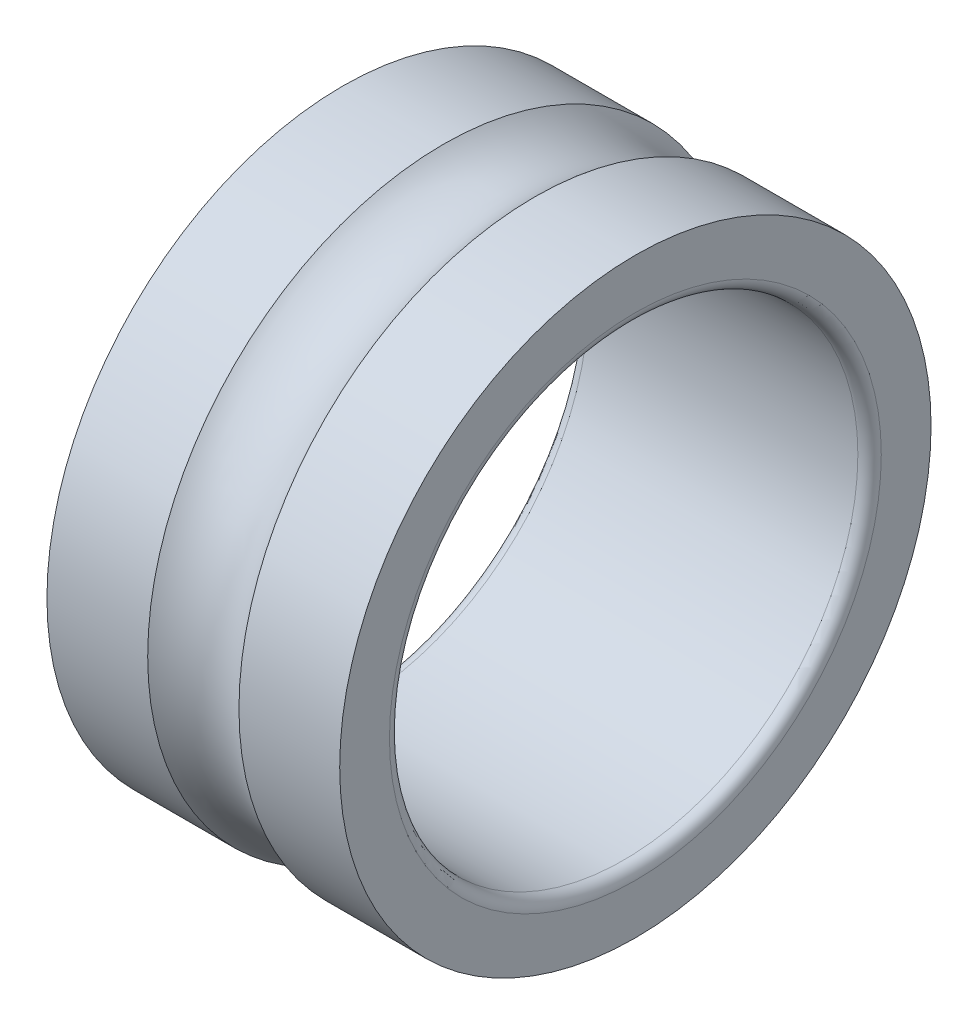
ISO-10303-21;
HEADER;
FILE_DESCRIPTION(('STEP AP214'),'2;1');
FILE_NAME('part.step','',(''),(''),'','','');
FILE_SCHEMA(('AUTOMOTIVE_DESIGN { 1 0 10303 214 1 1 1 1 }'));
ENDSEC;
DATA;
#1=APPLICATION_CONTEXT('core data for automotive mechanical design processes');
#2=APPLICATION_PROTOCOL_DEFINITION('international standard','automotive_design',2000,#1);
#3=PRODUCT_CONTEXT('',#1,'mechanical');
#4=PRODUCT('Part','Part','',(#3));
#5=PRODUCT_RELATED_PRODUCT_CATEGORY('part','',(#4));
#6=PRODUCT_DEFINITION_FORMATION('','',#4);
#7=PRODUCT_DEFINITION_CONTEXT('part definition',#1,'design');
#8=PRODUCT_DEFINITION('design','',#6,#7);
#9=PRODUCT_DEFINITION_SHAPE('','',#8);
#10=(LENGTH_UNIT() NAMED_UNIT(*) SI_UNIT(.MILLI.,.METRE.));
#11=(NAMED_UNIT(*) PLANE_ANGLE_UNIT() SI_UNIT($,.RADIAN.));
#12=(NAMED_UNIT(*) SI_UNIT($,.STERADIAN.) SOLID_ANGLE_UNIT());
#13=UNCERTAINTY_MEASURE_WITH_UNIT(LENGTH_MEASURE(1.E-05),#10,'distance_accuracy_value','');
#14=(GEOMETRIC_REPRESENTATION_CONTEXT(3) GLOBAL_UNCERTAINTY_ASSIGNED_CONTEXT((#13)) GLOBAL_UNIT_ASSIGNED_CONTEXT((#10,
#11,#12)) REPRESENTATION_CONTEXT('',''));
#15=CARTESIAN_POINT('',(0.,0.,0.));
#16=DIRECTION('',(0.,0.,1.));
#17=DIRECTION('',(1.,0.,0.));
#18=AXIS2_PLACEMENT_3D('',#15,#16,#17);
#19=CARTESIAN_POINT('',(2.5,0.,0.));
#20=DIRECTION('',(-1.,0.,0.));
#21=DIRECTION('',(0.,0.,1.));
#22=AXIS2_PLACEMENT_3D('',#19,#20,#21);
#23=TOROIDAL_SURFACE('',#22,5.95,1.1905);
#24=CARTESIAN_POINT('',(3.27928829710191,0.,0.));
#25=DIRECTION('',(-1.,0.,0.));
#26=DIRECTION('',(0.,0.,1.));
#27=AXIS2_PLACEMENT_3D('',#24,#25,#26);
#28=CIRCLE('',#27,5.05);
#29=CARTESIAN_POINT('',(3.27928829710191,0.,5.05));
#30=VERTEX_POINT('',#29);
#31=EDGE_CURVE('E55',#30,#30,#28,.T.);
#32=ORIENTED_EDGE('',*,*,#31,.T.);
#33=EDGE_LOOP('',(#32));
#34=FACE_BOUND('',#33,.T.);
#35=CARTESIAN_POINT('',(1.72071170289809,0.,0.));
#36=DIRECTION('',(-1.,0.,0.));
#37=DIRECTION('',(0.,0.,1.));
#38=AXIS2_PLACEMENT_3D('',#35,#36,#37);
#39=CIRCLE('',#38,5.05);
#40=CARTESIAN_POINT('',(1.72071170289809,0.,5.05));
#41=VERTEX_POINT('',#40);
#42=EDGE_CURVE('E10',#41,#41,#39,.T.);
#43=ORIENTED_EDGE('',*,*,#42,.F.);
#44=EDGE_LOOP('',(#43));
#45=FACE_BOUND('',#44,.T.);
#46=ADVANCED_FACE('F14',(#34,#45),#23,.F.);
#47=CARTESIAN_POINT('',(0.,0.,0.));
#48=DIRECTION('',(-1.,0.,0.));
#49=DIRECTION('',(0.,0.,1.));
#50=AXIS2_PLACEMENT_3D('',#47,#48,#49);
#51=CYLINDRICAL_SURFACE('',#50,5.05);
#52=ORIENTED_EDGE('',*,*,#42,.T.);
#53=EDGE_LOOP('',(#52));
#54=FACE_BOUND('',#53,.T.);
#55=CARTESIAN_POINT('',(0.,0.,0.));
#56=DIRECTION('',(-1.,0.,0.));
#57=DIRECTION('',(0.,0.,1.));
#58=AXIS2_PLACEMENT_3D('',#55,#56,#57);
#59=CIRCLE('',#58,5.05);
#60=CARTESIAN_POINT('',(0.,0.,5.05));
#61=VERTEX_POINT('',#60);
#62=EDGE_CURVE('E21',#61,#61,#59,.T.);
#63=ORIENTED_EDGE('',*,*,#62,.F.);
#64=EDGE_LOOP('',(#63));
#65=FACE_BOUND('',#64,.T.);
#66=ADVANCED_FACE('F76',(#54,#65),#51,.T.);
#67=CARTESIAN_POINT('',(0.,4.2,0.));
#68=DIRECTION('',(-1.,0.,0.));
#69=DIRECTION('',(0.,0.,1.));
#70=AXIS2_PLACEMENT_3D('',#67,#68,#69);
#71=PLANE('',#70);
#72=ORIENTED_EDGE('',*,*,#62,.T.);
#73=EDGE_LOOP('',(#72));
#74=FACE_BOUND('',#73,.T.);
#75=CARTESIAN_POINT('',(0.,0.,0.));
#76=DIRECTION('',(-1.,0.,0.));
#77=DIRECTION('',(0.,0.,1.));
#78=AXIS2_PLACEMENT_3D('',#75,#76,#77);
#79=CIRCLE('',#78,4.2);
#80=CARTESIAN_POINT('',(0.,0.,4.2));
#81=VERTEX_POINT('',#80);
#82=EDGE_CURVE('E30',#81,#81,#79,.T.);
#83=ORIENTED_EDGE('',*,*,#82,.F.);
#84=EDGE_LOOP('',(#83));
#85=FACE_BOUND('',#84,.T.);
#86=ADVANCED_FACE('F80',(#74,#85),#71,.T.);
#87=CARTESIAN_POINT('',(0.2,0.,0.));
#88=DIRECTION('',(-1.,0.,0.));
#89=DIRECTION('',(0.,0.,1.));
#90=AXIS2_PLACEMENT_3D('',#87,#88,#89);
#91=TOROIDAL_SURFACE('',#90,4.2,0.2);
#92=CARTESIAN_POINT('',(0.2,0.,0.));
#93=DIRECTION('',(-1.,0.,0.));
#94=DIRECTION('',(0.,0.,1.));
#95=AXIS2_PLACEMENT_3D('',#92,#93,#94);
#96=CIRCLE('',#95,4.);
#97=CARTESIAN_POINT('',(0.2,0.,4.));
#98=VERTEX_POINT('',#97);
#99=EDGE_CURVE('E37',#98,#98,#96,.T.);
#100=ORIENTED_EDGE('',*,*,#99,.F.);
#101=EDGE_LOOP('',(#100));
#102=FACE_BOUND('',#101,.T.);
#103=ORIENTED_EDGE('',*,*,#82,.T.);
#104=EDGE_LOOP('',(#103));
#105=FACE_BOUND('',#104,.T.);
#106=ADVANCED_FACE('F84',(#102,#105),#91,.T.);
#107=CARTESIAN_POINT('',(0.,0.,0.));
#108=DIRECTION('',(-1.,0.,0.));
#109=DIRECTION('',(0.,0.,1.));
#110=AXIS2_PLACEMENT_3D('',#107,#108,#109);
#111=CYLINDRICAL_SURFACE('',#110,4.);
#112=CARTESIAN_POINT('',(4.8,0.,0.));
#113=DIRECTION('',(-1.,0.,0.));
#114=DIRECTION('',(0.,0.,1.));
#115=AXIS2_PLACEMENT_3D('',#112,#113,#114);
#116=CIRCLE('',#115,4.);
#117=CARTESIAN_POINT('',(4.8,0.,4.));
#118=VERTEX_POINT('',#117);
#119=EDGE_CURVE('E43',#118,#118,#116,.T.);
#120=ORIENTED_EDGE('',*,*,#119,.F.);
#121=EDGE_LOOP('',(#120));
#122=FACE_BOUND('',#121,.T.);
#123=ORIENTED_EDGE('',*,*,#99,.T.);
#124=EDGE_LOOP('',(#123));
#125=FACE_BOUND('',#124,.T.);
#126=ADVANCED_FACE('F90',(#122,#125),#111,.F.);
#127=CARTESIAN_POINT('',(4.8,0.,0.));
#128=DIRECTION('',(-1.,0.,0.));
#129=DIRECTION('',(0.,0.,1.));
#130=AXIS2_PLACEMENT_3D('',#127,#128,#129);
#131=TOROIDAL_SURFACE('',#130,4.2,0.2);
#132=CARTESIAN_POINT('',(5.,0.,0.));
#133=DIRECTION('',(-1.,0.,0.));
#134=DIRECTION('',(0.,0.,1.));
#135=AXIS2_PLACEMENT_3D('',#132,#133,#134);
#136=CIRCLE('',#135,4.2);
#137=CARTESIAN_POINT('',(5.,0.,4.2));
#138=VERTEX_POINT('',#137);
#139=EDGE_CURVE('E47',#138,#138,#136,.T.);
#140=ORIENTED_EDGE('',*,*,#139,.F.);
#141=EDGE_LOOP('',(#140));
#142=FACE_BOUND('',#141,.T.);
#143=ORIENTED_EDGE('',*,*,#119,.T.);
#144=EDGE_LOOP('',(#143));
#145=FACE_BOUND('',#144,.T.);
#146=ADVANCED_FACE('F72',(#142,#145),#131,.T.);
#147=CARTESIAN_POINT('',(5.,4.2,0.));
#148=DIRECTION('',(-1.,0.,0.));
#149=DIRECTION('',(0.,0.,1.));
#150=AXIS2_PLACEMENT_3D('',#147,#148,#149);
#151=PLANE('',#150);
#152=CARTESIAN_POINT('',(5.,0.,0.));
#153=DIRECTION('',(-1.,0.,0.));
#154=DIRECTION('',(0.,0.,1.));
#155=AXIS2_PLACEMENT_3D('',#152,#153,#154);
#156=CIRCLE('',#155,5.05);
#157=CARTESIAN_POINT('',(5.,0.,5.05));
#158=VERTEX_POINT('',#157);
#159=EDGE_CURVE('E51',#158,#158,#156,.T.);
#160=ORIENTED_EDGE('',*,*,#159,.F.);
#161=EDGE_LOOP('',(#160));
#162=FACE_BOUND('',#161,.T.);
#163=ORIENTED_EDGE('',*,*,#139,.T.);
#164=EDGE_LOOP('',(#163));
#165=FACE_BOUND('',#164,.T.);
#166=ADVANCED_FACE('F65',(#162,#165),#151,.F.);
#167=CARTESIAN_POINT('',(0.,0.,0.));
#168=DIRECTION('',(-1.,0.,0.));
#169=DIRECTION('',(0.,0.,1.));
#170=AXIS2_PLACEMENT_3D('',#167,#168,#169);
#171=CYLINDRICAL_SURFACE('',#170,5.05);
#172=ORIENTED_EDGE('',*,*,#159,.T.);
#173=EDGE_LOOP('',(#172));
#174=FACE_BOUND('',#173,.T.);
#175=ORIENTED_EDGE('',*,*,#31,.F.);
#176=EDGE_LOOP('',(#175));
#177=FACE_BOUND('',#176,.T.);
#178=ADVANCED_FACE('F63',(#174,#177),#171,.T.);
#179=CLOSED_SHELL('',(#46,#66,#86,#106,#126,#146,#166,#178));
#180=MANIFOLD_SOLID_BREP('B1',#179);
#181=ADVANCED_BREP_SHAPE_REPRESENTATION('',(#18,#180),#14);
#182=SHAPE_DEFINITION_REPRESENTATION(#9,#181);
ENDSEC;
END-ISO-10303-21;
